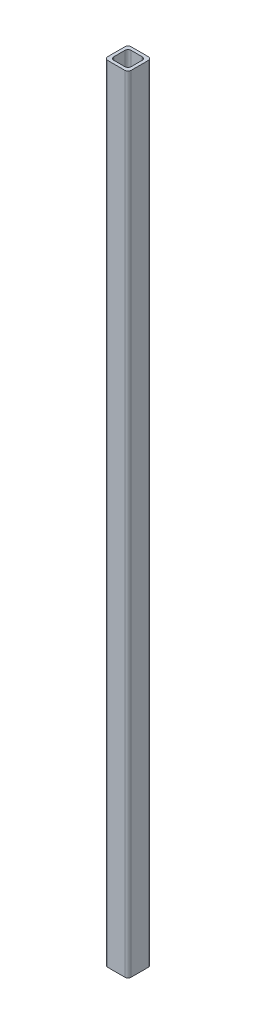
ISO-10303-21;
HEADER;
FILE_DESCRIPTION(('STEP AP214'),'2;1');
FILE_NAME('part.step','',(''),(''),'','','');
FILE_SCHEMA(('AUTOMOTIVE_DESIGN { 1 0 10303 214 1 1 1 1 }'));
ENDSEC;
DATA;
#1=APPLICATION_CONTEXT('core data for automotive mechanical design processes');
#2=APPLICATION_PROTOCOL_DEFINITION('international standard','automotive_design',2000,#1);
#3=PRODUCT_CONTEXT('',#1,'mechanical');
#4=PRODUCT('Part','Part','',(#3));
#5=PRODUCT_RELATED_PRODUCT_CATEGORY('part','',(#4));
#6=PRODUCT_DEFINITION_FORMATION('','',#4);
#7=PRODUCT_DEFINITION_CONTEXT('part definition',#1,'design');
#8=PRODUCT_DEFINITION('design','',#6,#7);
#9=PRODUCT_DEFINITION_SHAPE('','',#8);
#10=(LENGTH_UNIT() NAMED_UNIT(*) SI_UNIT(.MILLI.,.METRE.));
#11=(NAMED_UNIT(*) PLANE_ANGLE_UNIT() SI_UNIT($,.RADIAN.));
#12=(NAMED_UNIT(*) SI_UNIT($,.STERADIAN.) SOLID_ANGLE_UNIT());
#13=UNCERTAINTY_MEASURE_WITH_UNIT(LENGTH_MEASURE(1.E-05),#10,'distance_accuracy_value','');
#14=(GEOMETRIC_REPRESENTATION_CONTEXT(3) GLOBAL_UNCERTAINTY_ASSIGNED_CONTEXT((#13)) GLOBAL_UNIT_ASSIGNED_CONTEXT((#10,
#11,#12)) REPRESENTATION_CONTEXT('',''));
#15=CARTESIAN_POINT('',(0.,0.,0.));
#16=DIRECTION('',(0.,0.,1.));
#17=DIRECTION('',(1.,0.,0.));
#18=AXIS2_PLACEMENT_3D('',#15,#16,#17);
#19=CARTESIAN_POINT('',(11.,1000.,-11.));
#20=DIRECTION('',(0.,-1.,0.));
#21=DIRECTION('',(0.,0.,-1.));
#22=AXIS2_PLACEMENT_3D('',#19,#20,#21);
#23=PLANE('',#22);
#24=CARTESIAN_POINT('',(11.,1000.,-11.));
#25=DIRECTION('',(0.,1.,0.));
#26=DIRECTION('',(0.,0.,-1.));
#27=AXIS2_PLACEMENT_3D('',#24,#25,#26);
#28=CIRCLE('',#27,4.);
#29=CARTESIAN_POINT('',(15.,1000.,-11.));
#30=VERTEX_POINT('',#29);
#31=CARTESIAN_POINT('',(11.,1000.,-15.));
#32=VERTEX_POINT('',#31);
#33=EDGE_CURVE('E244',#30,#32,#28,.T.);
#34=ORIENTED_EDGE('',*,*,#33,.T.);
#35=DIRECTION('',(-1.,0.,0.));
#36=VECTOR('',#35,1.);
#37=CARTESIAN_POINT('',(11.,1000.,-15.));
#38=LINE('',#37,#36);
#39=CARTESIAN_POINT('',(-11.,1000.,-15.));
#40=VERTEX_POINT('',#39);
#41=EDGE_CURVE('E248',#32,#40,#38,.T.);
#42=ORIENTED_EDGE('',*,*,#41,.T.);
#43=CARTESIAN_POINT('',(-11.,1000.,-11.));
#44=DIRECTION('',(0.,1.,0.));
#45=DIRECTION('',(0.,0.,-1.));
#46=AXIS2_PLACEMENT_3D('',#43,#44,#45);
#47=CIRCLE('',#46,4.);
#48=CARTESIAN_POINT('',(-15.,1000.,-11.));
#49=VERTEX_POINT('',#48);
#50=EDGE_CURVE('E252',#40,#49,#47,.T.);
#51=ORIENTED_EDGE('',*,*,#50,.T.);
#52=DIRECTION('',(0.,0.,1.));
#53=VECTOR('',#52,1.);
#54=CARTESIAN_POINT('',(-15.,1000.,-11.));
#55=LINE('',#54,#53);
#56=CARTESIAN_POINT('',(-15.,1000.,11.));
#57=VERTEX_POINT('',#56);
#58=EDGE_CURVE('E255',#49,#57,#55,.T.);
#59=ORIENTED_EDGE('',*,*,#58,.T.);
#60=CARTESIAN_POINT('',(-11.,1000.,11.));
#61=DIRECTION('',(0.,1.,0.));
#62=DIRECTION('',(0.,0.,1.));
#63=AXIS2_PLACEMENT_3D('',#60,#61,#62);
#64=CIRCLE('',#63,4.);
#65=CARTESIAN_POINT('',(-11.,1000.,15.));
#66=VERTEX_POINT('',#65);
#67=EDGE_CURVE('E258',#57,#66,#64,.T.);
#68=ORIENTED_EDGE('',*,*,#67,.T.);
#69=DIRECTION('',(1.,0.,0.));
#70=VECTOR('',#69,1.);
#71=CARTESIAN_POINT('',(11.,1000.,15.));
#72=LINE('',#71,#70);
#73=CARTESIAN_POINT('',(11.,1000.,15.));
#74=VERTEX_POINT('',#73);
#75=EDGE_CURVE('E261',#66,#74,#72,.T.);
#76=ORIENTED_EDGE('',*,*,#75,.T.);
#77=CARTESIAN_POINT('',(11.,1000.,11.));
#78=DIRECTION('',(0.,1.,0.));
#79=DIRECTION('',(0.,0.,-1.));
#80=AXIS2_PLACEMENT_3D('',#77,#78,#79);
#81=CIRCLE('',#80,4.);
#82=CARTESIAN_POINT('',(15.,1000.,11.));
#83=VERTEX_POINT('',#82);
#84=EDGE_CURVE('E264',#74,#83,#81,.T.);
#85=ORIENTED_EDGE('',*,*,#84,.T.);
#86=DIRECTION('',(0.,0.,-1.));
#87=VECTOR('',#86,1.);
#88=CARTESIAN_POINT('',(15.,1000.,-11.));
#89=LINE('',#88,#87);
#90=EDGE_CURVE('E267',#83,#30,#89,.T.);
#91=ORIENTED_EDGE('',*,*,#90,.T.);
#92=EDGE_LOOP('',(#34,#42,#51,#59,#68,#76,#85,#91));
#93=FACE_BOUND('',#92,.T.);
#94=CARTESIAN_POINT('',(7.,1000.,-7.));
#95=DIRECTION('',(0.,1.,0.));
#96=DIRECTION('',(0.,0.,-1.));
#97=AXIS2_PLACEMENT_3D('',#94,#95,#96);
#98=CIRCLE('',#97,4.);
#99=CARTESIAN_POINT('',(11.,1000.,-6.99999999999997));
#100=VERTEX_POINT('',#99);
#101=CARTESIAN_POINT('',(6.99999999999997,1000.,-11.));
#102=VERTEX_POINT('',#101);
#103=EDGE_CURVE('E155',#100,#102,#98,.T.);
#104=ORIENTED_EDGE('',*,*,#103,.F.);
#105=DIRECTION('',(0.,0.,-1.));
#106=VECTOR('',#105,1.);
#107=CARTESIAN_POINT('',(11.,1000.,-6.99999999999997));
#108=LINE('',#107,#106);
#109=CARTESIAN_POINT('',(11.,1000.,6.99999999999997));
#110=VERTEX_POINT('',#109);
#111=EDGE_CURVE('E196',#110,#100,#108,.T.);
#112=ORIENTED_EDGE('',*,*,#111,.F.);
#113=CARTESIAN_POINT('',(7.,1000.,7.));
#114=DIRECTION('',(0.,1.,0.));
#115=DIRECTION('',(0.,0.,-1.));
#116=AXIS2_PLACEMENT_3D('',#113,#114,#115);
#117=CIRCLE('',#116,4.);
#118=CARTESIAN_POINT('',(6.99999999999997,1000.,11.));
#119=VERTEX_POINT('',#118);
#120=EDGE_CURVE('E193',#119,#110,#117,.T.);
#121=ORIENTED_EDGE('',*,*,#120,.F.);
#122=DIRECTION('',(1.,0.,0.));
#123=VECTOR('',#122,1.);
#124=CARTESIAN_POINT('',(6.99999999999997,1000.,11.));
#125=LINE('',#124,#123);
#126=CARTESIAN_POINT('',(-6.99999999999997,1000.,11.));
#127=VERTEX_POINT('',#126);
#128=EDGE_CURVE('E190',#127,#119,#125,.T.);
#129=ORIENTED_EDGE('',*,*,#128,.F.);
#130=CARTESIAN_POINT('',(-7.,1000.,7.));
#131=DIRECTION('',(0.,1.,0.));
#132=DIRECTION('',(0.,0.,-1.));
#133=AXIS2_PLACEMENT_3D('',#130,#131,#132);
#134=CIRCLE('',#133,4.);
#135=CARTESIAN_POINT('',(-11.,1000.,6.99999999999997));
#136=VERTEX_POINT('',#135);
#137=EDGE_CURVE('E187',#136,#127,#134,.T.);
#138=ORIENTED_EDGE('',*,*,#137,.F.);
#139=DIRECTION('',(0.,0.,1.));
#140=VECTOR('',#139,1.);
#141=CARTESIAN_POINT('',(-11.,1000.,-6.99999999999997));
#142=LINE('',#141,#140);
#143=CARTESIAN_POINT('',(-11.,1000.,-6.99999999999997));
#144=VERTEX_POINT('',#143);
#145=EDGE_CURVE('E182',#144,#136,#142,.T.);
#146=ORIENTED_EDGE('',*,*,#145,.F.);
#147=CARTESIAN_POINT('',(-7.,1000.,-7.));
#148=DIRECTION('',(0.,1.,0.));
#149=DIRECTION('',(0.,0.,1.));
#150=AXIS2_PLACEMENT_3D('',#147,#148,#149);
#151=CIRCLE('',#150,4.);
#152=CARTESIAN_POINT('',(-6.99999999999997,1000.,-11.));
#153=VERTEX_POINT('',#152);
#154=EDGE_CURVE('E178',#153,#144,#151,.T.);
#155=ORIENTED_EDGE('',*,*,#154,.F.);
#156=DIRECTION('',(-1.,0.,0.));
#157=VECTOR('',#156,1.);
#158=CARTESIAN_POINT('',(6.99999999999997,1000.,-11.));
#159=LINE('',#158,#157);
#160=EDGE_CURVE('E164',#102,#153,#159,.T.);
#161=ORIENTED_EDGE('',*,*,#160,.F.);
#162=EDGE_LOOP('',(#104,#112,#121,#129,#138,#146,#155,#161));
#163=FACE_BOUND('',#162,.T.);
#164=ADVANCED_FACE('F41',(#93,#163),#23,.F.);
#165=CARTESIAN_POINT('',(11.,0.,-11.));
#166=DIRECTION('',(0.,-1.,0.));
#167=DIRECTION('',(0.,0.,-1.));
#168=AXIS2_PLACEMENT_3D('',#165,#166,#167);
#169=PLANE('',#168);
#170=CARTESIAN_POINT('',(11.,0.,-11.));
#171=DIRECTION('',(0.,1.,0.));
#172=DIRECTION('',(0.,0.,-1.));
#173=AXIS2_PLACEMENT_3D('',#170,#171,#172);
#174=CIRCLE('',#173,4.);
#175=CARTESIAN_POINT('',(15.,0.,-11.));
#176=VERTEX_POINT('',#175);
#177=CARTESIAN_POINT('',(11.,0.,-15.));
#178=VERTEX_POINT('',#177);
#179=EDGE_CURVE('E173',#176,#178,#174,.T.);
#180=ORIENTED_EDGE('',*,*,#179,.F.);
#181=DIRECTION('',(0.,0.,-1.));
#182=VECTOR('',#181,1.);
#183=CARTESIAN_POINT('',(15.,0.,-11.));
#184=LINE('',#183,#182);
#185=CARTESIAN_POINT('',(15.,0.,11.));
#186=VERTEX_POINT('',#185);
#187=EDGE_CURVE('E249',#186,#176,#184,.T.);
#188=ORIENTED_EDGE('',*,*,#187,.F.);
#189=CARTESIAN_POINT('',(11.,0.,11.));
#190=DIRECTION('',(0.,1.,0.));
#191=DIRECTION('',(0.,0.,-1.));
#192=AXIS2_PLACEMENT_3D('',#189,#190,#191);
#193=CIRCLE('',#192,4.);
#194=CARTESIAN_POINT('',(11.,0.,15.));
#195=VERTEX_POINT('',#194);
#196=EDGE_CURVE('E289',#195,#186,#193,.T.);
#197=ORIENTED_EDGE('',*,*,#196,.F.);
#198=DIRECTION('',(1.,0.,0.));
#199=VECTOR('',#198,1.);
#200=CARTESIAN_POINT('',(11.,0.,15.));
#201=LINE('',#200,#199);
#202=CARTESIAN_POINT('',(-11.,0.,15.));
#203=VERTEX_POINT('',#202);
#204=EDGE_CURVE('E286',#203,#195,#201,.T.);
#205=ORIENTED_EDGE('',*,*,#204,.F.);
#206=CARTESIAN_POINT('',(-11.,0.,11.));
#207=DIRECTION('',(0.,1.,0.));
#208=DIRECTION('',(0.,0.,1.));
#209=AXIS2_PLACEMENT_3D('',#206,#207,#208);
#210=CIRCLE('',#209,4.);
#211=CARTESIAN_POINT('',(-15.,0.,11.));
#212=VERTEX_POINT('',#211);
#213=EDGE_CURVE('E283',#212,#203,#210,.T.);
#214=ORIENTED_EDGE('',*,*,#213,.F.);
#215=DIRECTION('',(0.,0.,1.));
#216=VECTOR('',#215,1.);
#217=CARTESIAN_POINT('',(-15.,0.,-11.));
#218=LINE('',#217,#216);
#219=CARTESIAN_POINT('',(-15.,0.,-11.));
#220=VERTEX_POINT('',#219);
#221=EDGE_CURVE('E280',#220,#212,#218,.T.);
#222=ORIENTED_EDGE('',*,*,#221,.F.);
#223=CARTESIAN_POINT('',(-11.,0.,-11.));
#224=DIRECTION('',(0.,1.,0.));
#225=DIRECTION('',(0.,0.,-1.));
#226=AXIS2_PLACEMENT_3D('',#223,#224,#225);
#227=CIRCLE('',#226,4.);
#228=CARTESIAN_POINT('',(-11.,0.,-15.));
#229=VERTEX_POINT('',#228);
#230=EDGE_CURVE('E277',#229,#220,#227,.T.);
#231=ORIENTED_EDGE('',*,*,#230,.F.);
#232=DIRECTION('',(-1.,0.,0.));
#233=VECTOR('',#232,1.);
#234=CARTESIAN_POINT('',(11.,0.,-15.));
#235=LINE('',#234,#233);
#236=EDGE_CURVE('E274',#178,#229,#235,.T.);
#237=ORIENTED_EDGE('',*,*,#236,.F.);
#238=EDGE_LOOP('',(#180,#188,#197,#205,#214,#222,#231,#237));
#239=FACE_BOUND('',#238,.T.);
#240=DIRECTION('',(0.,0.,-1.));
#241=VECTOR('',#240,1.);
#242=CARTESIAN_POINT('',(11.,0.,-6.99999999999997));
#243=LINE('',#242,#241);
#244=CARTESIAN_POINT('',(11.,0.,6.99999999999997));
#245=VERTEX_POINT('',#244);
#246=CARTESIAN_POINT('',(11.,0.,-6.99999999999997));
#247=VERTEX_POINT('',#246);
#248=EDGE_CURVE('E165',#245,#247,#243,.T.);
#249=ORIENTED_EDGE('',*,*,#248,.T.);
#250=CARTESIAN_POINT('',(7.,0.,-7.));
#251=DIRECTION('',(0.,1.,0.));
#252=DIRECTION('',(0.,0.,-1.));
#253=AXIS2_PLACEMENT_3D('',#250,#251,#252);
#254=CIRCLE('',#253,4.);
#255=CARTESIAN_POINT('',(6.99999999999997,0.,-11.));
#256=VERTEX_POINT('',#255);
#257=EDGE_CURVE('E65',#247,#256,#254,.T.);
#258=ORIENTED_EDGE('',*,*,#257,.T.);
#259=DIRECTION('',(-1.,0.,0.));
#260=VECTOR('',#259,1.);
#261=CARTESIAN_POINT('',(6.99999999999997,0.,-11.));
#262=LINE('',#261,#260);
#263=CARTESIAN_POINT('',(-6.99999999999997,0.,-11.));
#264=VERTEX_POINT('',#263);
#265=EDGE_CURVE('E171',#256,#264,#262,.T.);
#266=ORIENTED_EDGE('',*,*,#265,.T.);
#267=CARTESIAN_POINT('',(-7.,0.,-7.));
#268=DIRECTION('',(0.,1.,0.));
#269=DIRECTION('',(0.,0.,1.));
#270=AXIS2_PLACEMENT_3D('',#267,#268,#269);
#271=CIRCLE('',#270,4.);
#272=CARTESIAN_POINT('',(-11.,0.,-6.99999999999997));
#273=VERTEX_POINT('',#272);
#274=EDGE_CURVE('E203',#264,#273,#271,.T.);
#275=ORIENTED_EDGE('',*,*,#274,.T.);
#276=DIRECTION('',(0.,0.,1.));
#277=VECTOR('',#276,1.);
#278=CARTESIAN_POINT('',(-11.,0.,-6.99999999999997));
#279=LINE('',#278,#277);
#280=CARTESIAN_POINT('',(-11.,0.,6.99999999999997));
#281=VERTEX_POINT('',#280);
#282=EDGE_CURVE('E207',#273,#281,#279,.T.);
#283=ORIENTED_EDGE('',*,*,#282,.T.);
#284=CARTESIAN_POINT('',(-7.,0.,7.));
#285=DIRECTION('',(0.,1.,0.));
#286=DIRECTION('',(0.,0.,-1.));
#287=AXIS2_PLACEMENT_3D('',#284,#285,#286);
#288=CIRCLE('',#287,4.);
#289=CARTESIAN_POINT('',(-6.99999999999997,0.,11.));
#290=VERTEX_POINT('',#289);
#291=EDGE_CURVE('E211',#281,#290,#288,.T.);
#292=ORIENTED_EDGE('',*,*,#291,.T.);
#293=DIRECTION('',(1.,0.,0.));
#294=VECTOR('',#293,1.);
#295=CARTESIAN_POINT('',(6.99999999999997,0.,11.));
#296=LINE('',#295,#294);
#297=CARTESIAN_POINT('',(6.99999999999997,0.,11.));
#298=VERTEX_POINT('',#297);
#299=EDGE_CURVE('E215',#290,#298,#296,.T.);
#300=ORIENTED_EDGE('',*,*,#299,.T.);
#301=CARTESIAN_POINT('',(7.,0.,7.));
#302=DIRECTION('',(0.,1.,0.));
#303=DIRECTION('',(0.,0.,-1.));
#304=AXIS2_PLACEMENT_3D('',#301,#302,#303);
#305=CIRCLE('',#304,4.);
#306=EDGE_CURVE('E219',#298,#245,#305,.T.);
#307=ORIENTED_EDGE('',*,*,#306,.T.);
#308=EDGE_LOOP('',(#249,#258,#266,#275,#283,#292,#300,#307));
#309=FACE_BOUND('',#308,.T.);
#310=ADVANCED_FACE('F328',(#239,#309),#169,.T.);
#311=CARTESIAN_POINT('',(11.,1000.,-11.));
#312=DIRECTION('',(0.,-1.,0.));
#313=DIRECTION('',(0.,0.,-1.));
#314=AXIS2_PLACEMENT_3D('',#311,#312,#313);
#315=CYLINDRICAL_SURFACE('',#314,4.);
#316=ORIENTED_EDGE('',*,*,#179,.T.);
#317=DIRECTION('',(0.,-1.,0.));
#318=VECTOR('',#317,1.);
#319=CARTESIAN_POINT('',(11.,1000.,-15.));
#320=LINE('',#319,#318);
#321=EDGE_CURVE('E11',#32,#178,#320,.T.);
#322=ORIENTED_EDGE('',*,*,#321,.F.);
#323=ORIENTED_EDGE('',*,*,#33,.F.);
#324=DIRECTION('',(0.,-1.,0.));
#325=VECTOR('',#324,1.);
#326=CARTESIAN_POINT('',(15.,1000.,-11.));
#327=LINE('',#326,#325);
#328=EDGE_CURVE('E270',#30,#176,#327,.T.);
#329=ORIENTED_EDGE('',*,*,#328,.T.);
#330=EDGE_LOOP('',(#316,#322,#323,#329));
#331=FACE_BOUND('',#330,.T.);
#332=ADVANCED_FACE('F43',(#331),#315,.T.);
#333=CARTESIAN_POINT('',(11.,1000.,-15.));
#334=DIRECTION('',(0.,0.,1.));
#335=DIRECTION('',(1.,0.,0.));
#336=AXIS2_PLACEMENT_3D('',#333,#334,#335);
#337=PLANE('',#336);
#338=ORIENTED_EDGE('',*,*,#236,.T.);
#339=DIRECTION('',(0.,-1.,0.));
#340=VECTOR('',#339,1.);
#341=CARTESIAN_POINT('',(-11.,1000.,-15.));
#342=LINE('',#341,#340);
#343=EDGE_CURVE('E50',#40,#229,#342,.T.);
#344=ORIENTED_EDGE('',*,*,#343,.F.);
#345=ORIENTED_EDGE('',*,*,#41,.F.);
#346=ORIENTED_EDGE('',*,*,#321,.T.);
#347=EDGE_LOOP('',(#338,#344,#345,#346));
#348=FACE_BOUND('',#347,.T.);
#349=ADVANCED_FACE('F345',(#348),#337,.F.);
#350=CARTESIAN_POINT('',(-11.,1000.,-11.));
#351=DIRECTION('',(0.,-1.,0.));
#352=DIRECTION('',(0.,0.,-1.));
#353=AXIS2_PLACEMENT_3D('',#350,#351,#352);
#354=CYLINDRICAL_SURFACE('',#353,4.);
#355=ORIENTED_EDGE('',*,*,#230,.T.);
#356=DIRECTION('',(0.,-1.,0.));
#357=VECTOR('',#356,1.);
#358=CARTESIAN_POINT('',(-15.,1000.,-11.));
#359=LINE('',#358,#357);
#360=EDGE_CURVE('E313',#49,#220,#359,.T.);
#361=ORIENTED_EDGE('',*,*,#360,.F.);
#362=ORIENTED_EDGE('',*,*,#50,.F.);
#363=ORIENTED_EDGE('',*,*,#343,.T.);
#364=EDGE_LOOP('',(#355,#361,#362,#363));
#365=FACE_BOUND('',#364,.T.);
#366=ADVANCED_FACE('F322',(#365),#354,.T.);
#367=CARTESIAN_POINT('',(-15.,1000.,-11.));
#368=DIRECTION('',(1.,0.,0.));
#369=DIRECTION('',(0.,0.,-1.));
#370=AXIS2_PLACEMENT_3D('',#367,#368,#369);
#371=PLANE('',#370);
#372=ORIENTED_EDGE('',*,*,#221,.T.);
#373=DIRECTION('',(0.,-1.,0.));
#374=VECTOR('',#373,1.);
#375=CARTESIAN_POINT('',(-15.,1000.,11.));
#376=LINE('',#375,#374);
#377=EDGE_CURVE('E309',#57,#212,#376,.T.);
#378=ORIENTED_EDGE('',*,*,#377,.F.);
#379=ORIENTED_EDGE('',*,*,#58,.F.);
#380=ORIENTED_EDGE('',*,*,#360,.T.);
#381=EDGE_LOOP('',(#372,#378,#379,#380));
#382=FACE_BOUND('',#381,.T.);
#383=ADVANCED_FACE('F334',(#382),#371,.F.);
#384=CARTESIAN_POINT('',(-11.,1000.,11.));
#385=DIRECTION('',(0.,-1.,0.));
#386=DIRECTION('',(0.,0.,-1.));
#387=AXIS2_PLACEMENT_3D('',#384,#385,#386);
#388=CYLINDRICAL_SURFACE('',#387,4.);
#389=ORIENTED_EDGE('',*,*,#213,.T.);
#390=DIRECTION('',(0.,-1.,0.));
#391=VECTOR('',#390,1.);
#392=CARTESIAN_POINT('',(-11.,1000.,15.));
#393=LINE('',#392,#391);
#394=EDGE_CURVE('E305',#66,#203,#393,.T.);
#395=ORIENTED_EDGE('',*,*,#394,.F.);
#396=ORIENTED_EDGE('',*,*,#67,.F.);
#397=ORIENTED_EDGE('',*,*,#377,.T.);
#398=EDGE_LOOP('',(#389,#395,#396,#397));
#399=FACE_BOUND('',#398,.T.);
#400=ADVANCED_FACE('F338',(#399),#388,.T.);
#401=CARTESIAN_POINT('',(11.,1000.,15.));
#402=DIRECTION('',(0.,0.,-1.));
#403=DIRECTION('',(-1.,0.,0.));
#404=AXIS2_PLACEMENT_3D('',#401,#402,#403);
#405=PLANE('',#404);
#406=ORIENTED_EDGE('',*,*,#204,.T.);
#407=DIRECTION('',(0.,-1.,0.));
#408=VECTOR('',#407,1.);
#409=CARTESIAN_POINT('',(11.,1000.,15.));
#410=LINE('',#409,#408);
#411=EDGE_CURVE('E301',#74,#195,#410,.T.);
#412=ORIENTED_EDGE('',*,*,#411,.F.);
#413=ORIENTED_EDGE('',*,*,#75,.F.);
#414=ORIENTED_EDGE('',*,*,#394,.T.);
#415=EDGE_LOOP('',(#406,#412,#413,#414));
#416=FACE_BOUND('',#415,.T.);
#417=ADVANCED_FACE('F358',(#416),#405,.F.);
#418=CARTESIAN_POINT('',(11.,1000.,11.));
#419=DIRECTION('',(0.,-1.,0.));
#420=DIRECTION('',(0.,0.,-1.));
#421=AXIS2_PLACEMENT_3D('',#418,#419,#420);
#422=CYLINDRICAL_SURFACE('',#421,4.);
#423=ORIENTED_EDGE('',*,*,#196,.T.);
#424=DIRECTION('',(0.,-1.,0.));
#425=VECTOR('',#424,1.);
#426=CARTESIAN_POINT('',(15.,1000.,11.));
#427=LINE('',#426,#425);
#428=EDGE_CURVE('E297',#83,#186,#427,.T.);
#429=ORIENTED_EDGE('',*,*,#428,.F.);
#430=ORIENTED_EDGE('',*,*,#84,.F.);
#431=ORIENTED_EDGE('',*,*,#411,.T.);
#432=EDGE_LOOP('',(#423,#429,#430,#431));
#433=FACE_BOUND('',#432,.T.);
#434=ADVANCED_FACE('F356',(#433),#422,.T.);
#435=CARTESIAN_POINT('',(15.,1000.,-11.));
#436=DIRECTION('',(-1.,0.,0.));
#437=DIRECTION('',(0.,0.,1.));
#438=AXIS2_PLACEMENT_3D('',#435,#436,#437);
#439=PLANE('',#438);
#440=ORIENTED_EDGE('',*,*,#187,.T.);
#441=ORIENTED_EDGE('',*,*,#328,.F.);
#442=ORIENTED_EDGE('',*,*,#90,.F.);
#443=ORIENTED_EDGE('',*,*,#428,.T.);
#444=EDGE_LOOP('',(#440,#441,#442,#443));
#445=FACE_BOUND('',#444,.T.);
#446=ADVANCED_FACE('F351',(#445),#439,.F.);
#447=CARTESIAN_POINT('',(7.,1000.,-7.));
#448=DIRECTION('',(0.,-1.,0.));
#449=DIRECTION('',(0.,0.,-1.));
#450=AXIS2_PLACEMENT_3D('',#447,#448,#449);
#451=CYLINDRICAL_SURFACE('',#450,4.);
#452=ORIENTED_EDGE('',*,*,#257,.F.);
#453=DIRECTION('',(0.,-1.,0.));
#454=VECTOR('',#453,1.);
#455=CARTESIAN_POINT('',(11.,1000.,-6.99999999999997));
#456=LINE('',#455,#454);
#457=EDGE_CURVE('E159',#100,#247,#456,.T.);
#458=ORIENTED_EDGE('',*,*,#457,.F.);
#459=ORIENTED_EDGE('',*,*,#103,.T.);
#460=DIRECTION('',(0.,-1.,0.));
#461=VECTOR('',#460,1.);
#462=CARTESIAN_POINT('',(6.99999999999997,1000.,-11.));
#463=LINE('',#462,#461);
#464=EDGE_CURVE('E158',#102,#256,#463,.T.);
#465=ORIENTED_EDGE('',*,*,#464,.T.);
#466=EDGE_LOOP('',(#452,#458,#459,#465));
#467=FACE_BOUND('',#466,.T.);
#468=ADVANCED_FACE('F157',(#467),#451,.F.);
#469=CARTESIAN_POINT('',(6.99999999999997,1000.,-11.));
#470=DIRECTION('',(0.,0.,1.));
#471=DIRECTION('',(1.,0.,0.));
#472=AXIS2_PLACEMENT_3D('',#469,#470,#471);
#473=PLANE('',#472);
#474=ORIENTED_EDGE('',*,*,#265,.F.);
#475=ORIENTED_EDGE('',*,*,#464,.F.);
#476=ORIENTED_EDGE('',*,*,#160,.T.);
#477=DIRECTION('',(0.,-1.,0.));
#478=VECTOR('',#477,1.);
#479=CARTESIAN_POINT('',(-6.99999999999997,1000.,-11.));
#480=LINE('',#479,#478);
#481=EDGE_CURVE('E174',#153,#264,#480,.T.);
#482=ORIENTED_EDGE('',*,*,#481,.T.);
#483=EDGE_LOOP('',(#474,#475,#476,#482));
#484=FACE_BOUND('',#483,.T.);
#485=ADVANCED_FACE('F168',(#484),#473,.T.);
#486=CARTESIAN_POINT('',(-7.,1000.,-7.));
#487=DIRECTION('',(0.,-1.,0.));
#488=DIRECTION('',(0.,0.,-1.));
#489=AXIS2_PLACEMENT_3D('',#486,#487,#488);
#490=CYLINDRICAL_SURFACE('',#489,4.);
#491=ORIENTED_EDGE('',*,*,#274,.F.);
#492=ORIENTED_EDGE('',*,*,#481,.F.);
#493=ORIENTED_EDGE('',*,*,#154,.T.);
#494=DIRECTION('',(0.,-1.,0.));
#495=VECTOR('',#494,1.);
#496=CARTESIAN_POINT('',(-11.,1000.,-6.99999999999997));
#497=LINE('',#496,#495);
#498=EDGE_CURVE('E239',#144,#273,#497,.T.);
#499=ORIENTED_EDGE('',*,*,#498,.T.);
#500=EDGE_LOOP('',(#491,#492,#493,#499));
#501=FACE_BOUND('',#500,.T.);
#502=ADVANCED_FACE('F383',(#501),#490,.F.);
#503=CARTESIAN_POINT('',(-11.,1000.,-6.99999999999997));
#504=DIRECTION('',(1.,0.,0.));
#505=DIRECTION('',(0.,0.,-1.));
#506=AXIS2_PLACEMENT_3D('',#503,#504,#505);
#507=PLANE('',#506);
#508=ORIENTED_EDGE('',*,*,#282,.F.);
#509=ORIENTED_EDGE('',*,*,#498,.F.);
#510=ORIENTED_EDGE('',*,*,#145,.T.);
#511=DIRECTION('',(0.,-1.,0.));
#512=VECTOR('',#511,1.);
#513=CARTESIAN_POINT('',(-11.,1000.,6.99999999999997));
#514=LINE('',#513,#512);
#515=EDGE_CURVE('E236',#136,#281,#514,.T.);
#516=ORIENTED_EDGE('',*,*,#515,.T.);
#517=EDGE_LOOP('',(#508,#509,#510,#516));
#518=FACE_BOUND('',#517,.T.);
#519=ADVANCED_FACE('F387',(#518),#507,.T.);
#520=CARTESIAN_POINT('',(-7.,1000.,7.));
#521=DIRECTION('',(0.,-1.,0.));
#522=DIRECTION('',(0.,0.,-1.));
#523=AXIS2_PLACEMENT_3D('',#520,#521,#522);
#524=CYLINDRICAL_SURFACE('',#523,4.);
#525=ORIENTED_EDGE('',*,*,#291,.F.);
#526=ORIENTED_EDGE('',*,*,#515,.F.);
#527=ORIENTED_EDGE('',*,*,#137,.T.);
#528=DIRECTION('',(0.,-1.,0.));
#529=VECTOR('',#528,1.);
#530=CARTESIAN_POINT('',(-6.99999999999997,1000.,11.));
#531=LINE('',#530,#529);
#532=EDGE_CURVE('E233',#127,#290,#531,.T.);
#533=ORIENTED_EDGE('',*,*,#532,.T.);
#534=EDGE_LOOP('',(#525,#526,#527,#533));
#535=FACE_BOUND('',#534,.T.);
#536=ADVANCED_FACE('F393',(#535),#524,.F.);
#537=CARTESIAN_POINT('',(6.99999999999997,1000.,11.));
#538=DIRECTION('',(0.,0.,-1.));
#539=DIRECTION('',(-1.,0.,0.));
#540=AXIS2_PLACEMENT_3D('',#537,#538,#539);
#541=PLANE('',#540);
#542=ORIENTED_EDGE('',*,*,#299,.F.);
#543=ORIENTED_EDGE('',*,*,#532,.F.);
#544=ORIENTED_EDGE('',*,*,#128,.T.);
#545=DIRECTION('',(0.,-1.,0.));
#546=VECTOR('',#545,1.);
#547=CARTESIAN_POINT('',(6.99999999999997,1000.,11.));
#548=LINE('',#547,#546);
#549=EDGE_CURVE('E230',#119,#298,#548,.T.);
#550=ORIENTED_EDGE('',*,*,#549,.T.);
#551=EDGE_LOOP('',(#542,#543,#544,#550));
#552=FACE_BOUND('',#551,.T.);
#553=ADVANCED_FACE('F397',(#552),#541,.T.);
#554=CARTESIAN_POINT('',(7.,1000.,7.));
#555=DIRECTION('',(0.,-1.,0.));
#556=DIRECTION('',(0.,0.,-1.));
#557=AXIS2_PLACEMENT_3D('',#554,#555,#556);
#558=CYLINDRICAL_SURFACE('',#557,4.);
#559=ORIENTED_EDGE('',*,*,#306,.F.);
#560=ORIENTED_EDGE('',*,*,#549,.F.);
#561=ORIENTED_EDGE('',*,*,#120,.T.);
#562=DIRECTION('',(0.,-1.,0.));
#563=VECTOR('',#562,1.);
#564=CARTESIAN_POINT('',(11.,1000.,6.99999999999997));
#565=LINE('',#564,#563);
#566=EDGE_CURVE('E57',#110,#245,#565,.T.);
#567=ORIENTED_EDGE('',*,*,#566,.T.);
#568=EDGE_LOOP('',(#559,#560,#561,#567));
#569=FACE_BOUND('',#568,.T.);
#570=ADVANCED_FACE('F401',(#569),#558,.F.);
#571=CARTESIAN_POINT('',(11.,1000.,-6.99999999999997));
#572=DIRECTION('',(-1.,0.,0.));
#573=DIRECTION('',(0.,0.,1.));
#574=AXIS2_PLACEMENT_3D('',#571,#572,#573);
#575=PLANE('',#574);
#576=ORIENTED_EDGE('',*,*,#248,.F.);
#577=ORIENTED_EDGE('',*,*,#566,.F.);
#578=ORIENTED_EDGE('',*,*,#111,.T.);
#579=ORIENTED_EDGE('',*,*,#457,.T.);
#580=EDGE_LOOP('',(#576,#577,#578,#579));
#581=FACE_BOUND('',#580,.T.);
#582=ADVANCED_FACE('F405',(#581),#575,.T.);
#583=CLOSED_SHELL('',(#164,#310,#332,#349,#366,#383,#400,#417,#434,#446,#468,#485,#502,#519,
#536,#553,#570,#582));
#584=MANIFOLD_SOLID_BREP('B2',#583);
#585=ADVANCED_BREP_SHAPE_REPRESENTATION('',(#18,#584),#14);
#586=SHAPE_DEFINITION_REPRESENTATION(#9,#585);
ENDSEC;
END-ISO-10303-21;
